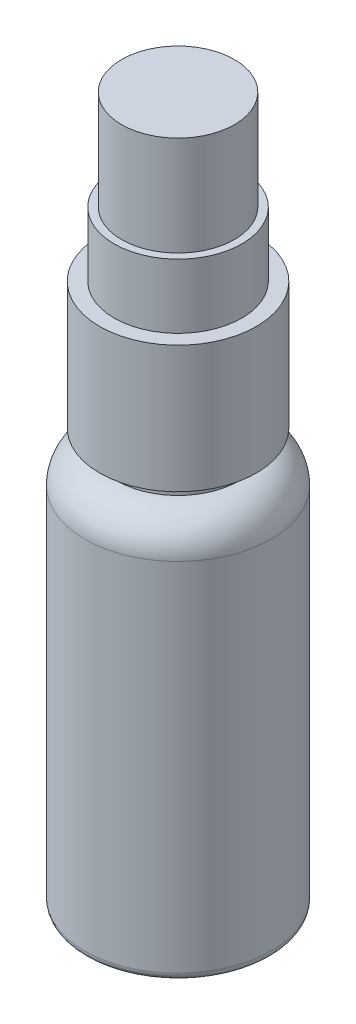
ISO-10303-21;
HEADER;
FILE_DESCRIPTION(('STEP AP214'),'2;1');
FILE_NAME('part.step','',(''),(''),'','','');
FILE_SCHEMA(('AUTOMOTIVE_DESIGN { 1 0 10303 214 1 1 1 1 }'));
ENDSEC;
DATA;
#1=APPLICATION_CONTEXT('core data for automotive mechanical design processes');
#2=APPLICATION_PROTOCOL_DEFINITION('international standard','automotive_design',2000,#1);
#3=PRODUCT_CONTEXT('',#1,'mechanical');
#4=PRODUCT('Part','Part','',(#3));
#5=PRODUCT_RELATED_PRODUCT_CATEGORY('part','',(#4));
#6=PRODUCT_DEFINITION_FORMATION('','',#4);
#7=PRODUCT_DEFINITION_CONTEXT('part definition',#1,'design');
#8=PRODUCT_DEFINITION('design','',#6,#7);
#9=PRODUCT_DEFINITION_SHAPE('','',#8);
#10=(LENGTH_UNIT() NAMED_UNIT(*) SI_UNIT(.MILLI.,.METRE.));
#11=(NAMED_UNIT(*) PLANE_ANGLE_UNIT() SI_UNIT($,.RADIAN.));
#12=(NAMED_UNIT(*) SI_UNIT($,.STERADIAN.) SOLID_ANGLE_UNIT());
#13=UNCERTAINTY_MEASURE_WITH_UNIT(LENGTH_MEASURE(1.E-05),#10,'distance_accuracy_value','');
#14=(GEOMETRIC_REPRESENTATION_CONTEXT(3) GLOBAL_UNCERTAINTY_ASSIGNED_CONTEXT((#13)) GLOBAL_UNIT_ASSIGNED_CONTEXT((#10,
#11,#12)) REPRESENTATION_CONTEXT('',''));
#15=CARTESIAN_POINT('',(0.,0.,0.));
#16=DIRECTION('',(0.,0.,1.));
#17=DIRECTION('',(1.,0.,0.));
#18=AXIS2_PLACEMENT_3D('',#15,#16,#17);
#19=CARTESIAN_POINT('',(7.5,50.875,0.));
#20=DIRECTION('',(0.,1.,0.));
#21=DIRECTION('',(0.,0.,1.));
#22=AXIS2_PLACEMENT_3D('',#19,#20,#21);
#23=PLANE('',#22);
#24=CARTESIAN_POINT('',(0.,50.875,0.));
#25=DIRECTION('',(0.,1.,0.));
#26=DIRECTION('',(0.,0.,1.));
#27=AXIS2_PLACEMENT_3D('',#24,#25,#26);
#28=CIRCLE('',#27,7.75);
#29=CARTESIAN_POINT('',(0.,50.875,7.75));
#30=VERTEX_POINT('',#29);
#31=EDGE_CURVE('E10',#30,#30,#28,.T.);
#32=ORIENTED_EDGE('',*,*,#31,.F.);
#33=EDGE_LOOP('',(#32));
#34=FACE_BOUND('',#33,.T.);
#35=CARTESIAN_POINT('',(0.,50.875,0.));
#36=DIRECTION('',(0.,1.,0.));
#37=DIRECTION('',(0.,0.,1.));
#38=AXIS2_PLACEMENT_3D('',#35,#36,#37);
#39=CIRCLE('',#38,7.5);
#40=CARTESIAN_POINT('',(0.,50.875,7.5));
#41=VERTEX_POINT('',#40);
#42=EDGE_CURVE('E89',#41,#41,#39,.T.);
#43=ORIENTED_EDGE('',*,*,#42,.T.);
#44=EDGE_LOOP('',(#43));
#45=FACE_BOUND('',#44,.T.);
#46=ADVANCED_FACE('F37',(#34,#45),#23,.F.);
#47=CARTESIAN_POINT('',(0.,65.8,0.));
#48=DIRECTION('',(0.,1.,0.));
#49=DIRECTION('',(0.,0.,1.));
#50=AXIS2_PLACEMENT_3D('',#47,#48,#49);
#51=CYLINDRICAL_SURFACE('',#50,7.75);
#52=CARTESIAN_POINT('',(0.,52.875,0.));
#53=DIRECTION('',(0.,1.,0.));
#54=DIRECTION('',(0.,0.,1.));
#55=AXIS2_PLACEMENT_3D('',#52,#53,#54);
#56=CIRCLE('',#55,7.75);
#57=CARTESIAN_POINT('',(0.,52.875,7.75));
#58=VERTEX_POINT('',#57);
#59=EDGE_CURVE('E43',#58,#58,#56,.T.);
#60=ORIENTED_EDGE('',*,*,#59,.F.);
#61=EDGE_LOOP('',(#60));
#62=FACE_BOUND('',#61,.T.);
#63=ORIENTED_EDGE('',*,*,#31,.T.);
#64=EDGE_LOOP('',(#63));
#65=FACE_BOUND('',#64,.T.);
#66=ADVANCED_FACE('F130',(#62,#65),#51,.T.);
#67=CARTESIAN_POINT('',(7.75,52.875,0.));
#68=DIRECTION('',(0.,1.,0.));
#69=DIRECTION('',(0.,0.,1.));
#70=AXIS2_PLACEMENT_3D('',#67,#68,#69);
#71=PLANE('',#70);
#72=CARTESIAN_POINT('',(0.,52.875,0.));
#73=DIRECTION('',(0.,1.,0.));
#74=DIRECTION('',(0.,0.,1.));
#75=AXIS2_PLACEMENT_3D('',#72,#73,#74);
#76=CIRCLE('',#75,10.);
#77=CARTESIAN_POINT('',(0.,52.875,10.));
#78=VERTEX_POINT('',#77);
#79=EDGE_CURVE('E47',#78,#78,#76,.T.);
#80=ORIENTED_EDGE('',*,*,#79,.F.);
#81=EDGE_LOOP('',(#80));
#82=FACE_BOUND('',#81,.T.);
#83=ORIENTED_EDGE('',*,*,#59,.T.);
#84=EDGE_LOOP('',(#83));
#85=FACE_BOUND('',#84,.T.);
#86=ADVANCED_FACE('F135',(#82,#85),#71,.F.);
#87=CARTESIAN_POINT('',(0.,65.8,0.));
#88=DIRECTION('',(0.,1.,0.));
#89=DIRECTION('',(0.,0.,1.));
#90=AXIS2_PLACEMENT_3D('',#87,#88,#89);
#91=CYLINDRICAL_SURFACE('',#90,10.);
#92=CARTESIAN_POINT('',(0.,69.075,0.));
#93=DIRECTION('',(0.,1.,0.));
#94=DIRECTION('',(0.,0.,1.));
#95=AXIS2_PLACEMENT_3D('',#92,#93,#94);
#96=CIRCLE('',#95,10.);
#97=CARTESIAN_POINT('',(0.,69.075,10.));
#98=VERTEX_POINT('',#97);
#99=EDGE_CURVE('E51',#98,#98,#96,.T.);
#100=ORIENTED_EDGE('',*,*,#99,.F.);
#101=EDGE_LOOP('',(#100));
#102=FACE_BOUND('',#101,.T.);
#103=ORIENTED_EDGE('',*,*,#79,.T.);
#104=EDGE_LOOP('',(#103));
#105=FACE_BOUND('',#104,.T.);
#106=ADVANCED_FACE('F140',(#102,#105),#91,.T.);
#107=CARTESIAN_POINT('',(10.,69.075,0.));
#108=DIRECTION('',(0.,-1.,0.));
#109=DIRECTION('',(0.,0.,-1.));
#110=AXIS2_PLACEMENT_3D('',#107,#108,#109);
#111=PLANE('',#110);
#112=CARTESIAN_POINT('',(0.,69.075,0.));
#113=DIRECTION('',(0.,1.,0.));
#114=DIRECTION('',(0.,0.,1.));
#115=AXIS2_PLACEMENT_3D('',#112,#113,#114);
#116=CIRCLE('',#115,8.15);
#117=CARTESIAN_POINT('',(0.,69.075,8.15));
#118=VERTEX_POINT('',#117);
#119=EDGE_CURVE('E56',#118,#118,#116,.T.);
#120=ORIENTED_EDGE('',*,*,#119,.F.);
#121=EDGE_LOOP('',(#120));
#122=FACE_BOUND('',#121,.T.);
#123=ORIENTED_EDGE('',*,*,#99,.T.);
#124=EDGE_LOOP('',(#123));
#125=FACE_BOUND('',#124,.T.);
#126=ADVANCED_FACE('F146',(#122,#125),#111,.F.);
#127=CARTESIAN_POINT('',(0.,65.8,0.));
#128=DIRECTION('',(0.,1.,0.));
#129=DIRECTION('',(0.,0.,1.));
#130=AXIS2_PLACEMENT_3D('',#127,#128,#129);
#131=CYLINDRICAL_SURFACE('',#130,8.15);
#132=CARTESIAN_POINT('',(0.,77.275,0.));
#133=DIRECTION('',(0.,1.,0.));
#134=DIRECTION('',(0.,0.,1.));
#135=AXIS2_PLACEMENT_3D('',#132,#133,#134);
#136=CIRCLE('',#135,8.15);
#137=CARTESIAN_POINT('',(0.,77.275,8.15));
#138=VERTEX_POINT('',#137);
#139=EDGE_CURVE('E59',#138,#138,#136,.T.);
#140=ORIENTED_EDGE('',*,*,#139,.F.);
#141=EDGE_LOOP('',(#140));
#142=FACE_BOUND('',#141,.T.);
#143=ORIENTED_EDGE('',*,*,#119,.T.);
#144=EDGE_LOOP('',(#143));
#145=FACE_BOUND('',#144,.T.);
#146=ADVANCED_FACE('F150',(#142,#145),#131,.T.);
#147=CARTESIAN_POINT('',(8.15,77.275,0.));
#148=DIRECTION('',(0.,-1.,0.));
#149=DIRECTION('',(0.,0.,-1.));
#150=AXIS2_PLACEMENT_3D('',#147,#148,#149);
#151=PLANE('',#150);
#152=CARTESIAN_POINT('',(0.,77.275,0.));
#153=DIRECTION('',(0.,1.,0.));
#154=DIRECTION('',(0.,0.,1.));
#155=AXIS2_PLACEMENT_3D('',#152,#153,#154);
#156=CIRCLE('',#155,7.2);
#157=CARTESIAN_POINT('',(0.,77.275,7.2));
#158=VERTEX_POINT('',#157);
#159=EDGE_CURVE('E62',#158,#158,#156,.T.);
#160=ORIENTED_EDGE('',*,*,#159,.F.);
#161=EDGE_LOOP('',(#160));
#162=FACE_BOUND('',#161,.T.);
#163=ORIENTED_EDGE('',*,*,#139,.T.);
#164=EDGE_LOOP('',(#163));
#165=FACE_BOUND('',#164,.T.);
#166=ADVANCED_FACE('F154',(#162,#165),#151,.F.);
#167=CARTESIAN_POINT('',(0.,65.8,0.));
#168=DIRECTION('',(0.,1.,0.));
#169=DIRECTION('',(0.,0.,1.));
#170=AXIS2_PLACEMENT_3D('',#167,#168,#169);
#171=CYLINDRICAL_SURFACE('',#170,7.2);
#172=CARTESIAN_POINT('',(0.,89.975,0.));
#173=DIRECTION('',(0.,1.,0.));
#174=DIRECTION('',(0.,0.,1.));
#175=AXIS2_PLACEMENT_3D('',#172,#173,#174);
#176=CIRCLE('',#175,7.2);
#177=CARTESIAN_POINT('',(0.,89.975,7.2));
#178=VERTEX_POINT('',#177);
#179=EDGE_CURVE('E65',#178,#178,#176,.T.);
#180=ORIENTED_EDGE('',*,*,#179,.F.);
#181=EDGE_LOOP('',(#180));
#182=FACE_BOUND('',#181,.T.);
#183=ORIENTED_EDGE('',*,*,#159,.T.);
#184=EDGE_LOOP('',(#183));
#185=FACE_BOUND('',#184,.T.);
#186=ADVANCED_FACE('F158',(#182,#185),#171,.T.);
#187=CARTESIAN_POINT('',(0.,89.975,0.));
#188=DIRECTION('',(0.,1.,0.));
#189=DIRECTION('',(0.,0.,1.));
#190=AXIS2_PLACEMENT_3D('',#187,#188,#189);
#191=PLANE('',#190);
#192=ORIENTED_EDGE('',*,*,#179,.T.);
#193=EDGE_LOOP('',(#192));
#194=FACE_BOUND('',#193,.T.);
#195=ADVANCED_FACE('F162',(#194),#191,.T.);
#196=CARTESIAN_POINT('',(7.75,2.40955855165527,0.));
#197=DIRECTION('',(0.,-1.,0.));
#198=DIRECTION('',(0.,0.,-1.));
#199=AXIS2_PLACEMENT_3D('',#196,#197,#198);
#200=PLANE('',#199);
#201=CARTESIAN_POINT('',(0.,2.40955855165527,0.));
#202=DIRECTION('',(0.,1.,0.));
#203=DIRECTION('',(0.,0.,1.));
#204=AXIS2_PLACEMENT_3D('',#201,#202,#203);
#205=CIRCLE('',#204,7.75);
#206=CARTESIAN_POINT('',(0.,2.40955855165527,7.75));
#207=VERTEX_POINT('',#206);
#208=EDGE_CURVE('E68',#207,#207,#205,.T.);
#209=ORIENTED_EDGE('',*,*,#208,.F.);
#210=EDGE_LOOP('',(#209));
#211=FACE_BOUND('',#210,.T.);
#212=ADVANCED_FACE('F166',(#211),#200,.T.);
#213=CARTESIAN_POINT('',(0.,1.40955855165527,0.));
#214=DIRECTION('',(0.,1.,0.));
#215=DIRECTION('',(0.,0.,1.));
#216=AXIS2_PLACEMENT_3D('',#213,#214,#215);
#217=TOROIDAL_SURFACE('',#216,7.75,1.);
#218=ORIENTED_EDGE('',*,*,#208,.T.);
#219=EDGE_LOOP('',(#218));
#220=FACE_BOUND('',#219,.T.);
#221=CARTESIAN_POINT('',(0.,1.40955855165527,0.));
#222=DIRECTION('',(0.,1.,0.));
#223=DIRECTION('',(0.,0.,1.));
#224=AXIS2_PLACEMENT_3D('',#221,#222,#223);
#225=CIRCLE('',#224,8.75);
#226=CARTESIAN_POINT('',(0.,1.40955855165527,8.75));
#227=VERTEX_POINT('',#226);
#228=EDGE_CURVE('E71',#227,#227,#225,.T.);
#229=ORIENTED_EDGE('',*,*,#228,.F.);
#230=EDGE_LOOP('',(#229));
#231=FACE_BOUND('',#230,.T.);
#232=ADVANCED_FACE('F126',(#220,#231),#217,.F.);
#233=CARTESIAN_POINT('',(0.,65.8,0.));
#234=DIRECTION('',(0.,1.,0.));
#235=DIRECTION('',(0.,0.,1.));
#236=AXIS2_PLACEMENT_3D('',#233,#234,#235);
#237=CYLINDRICAL_SURFACE('',#236,8.75);
#238=ORIENTED_EDGE('',*,*,#228,.T.);
#239=EDGE_LOOP('',(#238));
#240=FACE_BOUND('',#239,.T.);
#241=CARTESIAN_POINT('',(0.,1.,0.));
#242=DIRECTION('',(0.,1.,0.));
#243=DIRECTION('',(0.,0.,1.));
#244=AXIS2_PLACEMENT_3D('',#241,#242,#243);
#245=CIRCLE('',#244,8.75);
#246=CARTESIAN_POINT('',(0.,1.,8.75));
#247=VERTEX_POINT('',#246);
#248=EDGE_CURVE('E74',#247,#247,#245,.T.);
#249=ORIENTED_EDGE('',*,*,#248,.F.);
#250=EDGE_LOOP('',(#249));
#251=FACE_BOUND('',#250,.T.);
#252=ADVANCED_FACE('F120',(#240,#251),#237,.F.);
#253=CARTESIAN_POINT('',(0.,1.,0.));
#254=DIRECTION('',(0.,1.,0.));
#255=DIRECTION('',(0.,0.,1.));
#256=AXIS2_PLACEMENT_3D('',#253,#254,#255);
#257=TOROIDAL_SURFACE('',#256,9.75,1.);
#258=ORIENTED_EDGE('',*,*,#248,.T.);
#259=EDGE_LOOP('',(#258));
#260=FACE_BOUND('',#259,.T.);
#261=CARTESIAN_POINT('',(0.,0.,0.));
#262=DIRECTION('',(0.,1.,0.));
#263=DIRECTION('',(0.,0.,1.));
#264=AXIS2_PLACEMENT_3D('',#261,#262,#263);
#265=CIRCLE('',#264,9.75);
#266=CARTESIAN_POINT('',(0.,0.,9.75));
#267=VERTEX_POINT('',#266);
#268=EDGE_CURVE('E77',#267,#267,#265,.T.);
#269=ORIENTED_EDGE('',*,*,#268,.F.);
#270=EDGE_LOOP('',(#269));
#271=FACE_BOUND('',#270,.T.);
#272=ADVANCED_FACE('F115',(#260,#271),#257,.T.);
#273=CARTESIAN_POINT('',(9.75,0.,0.));
#274=DIRECTION('',(0.,1.,0.));
#275=DIRECTION('',(0.,0.,1.));
#276=AXIS2_PLACEMENT_3D('',#273,#274,#275);
#277=PLANE('',#276);
#278=CARTESIAN_POINT('',(0.,0.,0.));
#279=DIRECTION('',(0.,1.,0.));
#280=DIRECTION('',(0.,0.,1.));
#281=AXIS2_PLACEMENT_3D('',#278,#279,#280);
#282=CIRCLE('',#281,10.875);
#283=CARTESIAN_POINT('',(0.,0.,10.875));
#284=VERTEX_POINT('',#283);
#285=EDGE_CURVE('E80',#284,#284,#282,.T.);
#286=ORIENTED_EDGE('',*,*,#285,.F.);
#287=EDGE_LOOP('',(#286));
#288=FACE_BOUND('',#287,.T.);
#289=ORIENTED_EDGE('',*,*,#268,.T.);
#290=EDGE_LOOP('',(#289));
#291=FACE_BOUND('',#290,.T.);
#292=ADVANCED_FACE('F109',(#288,#291),#277,.F.);
#293=CARTESIAN_POINT('',(0.,1.,0.));
#294=DIRECTION('',(0.,1.,0.));
#295=DIRECTION('',(0.,0.,1.));
#296=AXIS2_PLACEMENT_3D('',#293,#294,#295);
#297=TOROIDAL_SURFACE('',#296,10.875,1.);
#298=CARTESIAN_POINT('',(0.,1.,0.));
#299=DIRECTION('',(0.,1.,0.));
#300=DIRECTION('',(0.,0.,1.));
#301=AXIS2_PLACEMENT_3D('',#298,#299,#300);
#302=CIRCLE('',#301,11.875);
#303=CARTESIAN_POINT('',(0.,1.,11.875));
#304=VERTEX_POINT('',#303);
#305=EDGE_CURVE('E83',#304,#304,#302,.T.);
#306=ORIENTED_EDGE('',*,*,#305,.F.);
#307=EDGE_LOOP('',(#306));
#308=FACE_BOUND('',#307,.T.);
#309=ORIENTED_EDGE('',*,*,#285,.T.);
#310=EDGE_LOOP('',(#309));
#311=FACE_BOUND('',#310,.T.);
#312=ADVANCED_FACE('F103',(#308,#311),#297,.T.);
#313=CARTESIAN_POINT('',(0.,65.8,0.));
#314=DIRECTION('',(0.,1.,0.));
#315=DIRECTION('',(0.,0.,1.));
#316=AXIS2_PLACEMENT_3D('',#313,#314,#315);
#317=CYLINDRICAL_SURFACE('',#316,11.875);
#318=CARTESIAN_POINT('',(0.,46.5,0.));
#319=DIRECTION('',(0.,1.,0.));
#320=DIRECTION('',(0.,0.,1.));
#321=AXIS2_PLACEMENT_3D('',#318,#319,#320);
#322=CIRCLE('',#321,11.875);
#323=CARTESIAN_POINT('',(0.,46.5,11.875));
#324=VERTEX_POINT('',#323);
#325=EDGE_CURVE('E86',#324,#324,#322,.T.);
#326=ORIENTED_EDGE('',*,*,#325,.F.);
#327=EDGE_LOOP('',(#326));
#328=FACE_BOUND('',#327,.T.);
#329=ORIENTED_EDGE('',*,*,#305,.T.);
#330=EDGE_LOOP('',(#329));
#331=FACE_BOUND('',#330,.T.);
#332=ADVANCED_FACE('F97',(#328,#331),#317,.T.);
#333=CARTESIAN_POINT('',(0.,46.5,0.));
#334=DIRECTION('',(0.,1.,0.));
#335=DIRECTION('',(0.,0.,1.));
#336=AXIS2_PLACEMENT_3D('',#333,#334,#335);
#337=TOROIDAL_SURFACE('',#336,7.5,4.375);
#338=ORIENTED_EDGE('',*,*,#42,.F.);
#339=EDGE_LOOP('',(#338));
#340=FACE_BOUND('',#339,.T.);
#341=ORIENTED_EDGE('',*,*,#325,.T.);
#342=EDGE_LOOP('',(#341));
#343=FACE_BOUND('',#342,.T.);
#344=ADVANCED_FACE('F94',(#340,#343),#337,.T.);
#345=CLOSED_SHELL('',(#46,#66,#86,#106,#126,#146,#166,#186,#195,#212,#232,#252,#272,#292,#312,
#332,#344));
#346=MANIFOLD_SOLID_BREP('B2',#345);
#347=ADVANCED_BREP_SHAPE_REPRESENTATION('',(#18,#346),#14);
#348=SHAPE_DEFINITION_REPRESENTATION(#9,#347);
ENDSEC;
END-ISO-10303-21;
